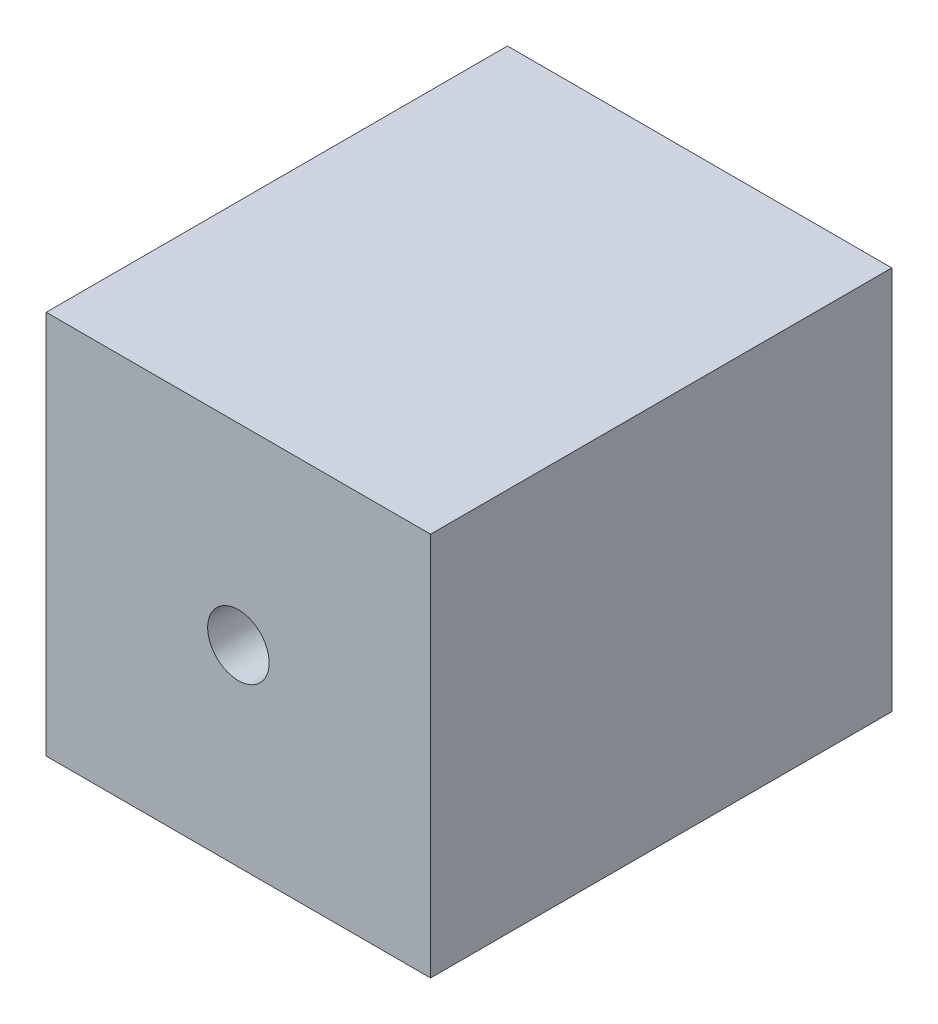
ISO-10303-21;
HEADER;
FILE_DESCRIPTION(('STEP AP214'),'2;1');
FILE_NAME('part.step','',(''),(''),'','','');
FILE_SCHEMA(('AUTOMOTIVE_DESIGN { 1 0 10303 214 1 1 1 1 }'));
ENDSEC;
DATA;
#1=APPLICATION_CONTEXT('core data for automotive mechanical design processes');
#2=APPLICATION_PROTOCOL_DEFINITION('international standard','automotive_design',2000,#1);
#3=PRODUCT_CONTEXT('',#1,'mechanical');
#4=PRODUCT('Part','Part','',(#3));
#5=PRODUCT_RELATED_PRODUCT_CATEGORY('part','',(#4));
#6=PRODUCT_DEFINITION_FORMATION('','',#4);
#7=PRODUCT_DEFINITION_CONTEXT('part definition',#1,'design');
#8=PRODUCT_DEFINITION('design','',#6,#7);
#9=PRODUCT_DEFINITION_SHAPE('','',#8);
#10=(LENGTH_UNIT() NAMED_UNIT(*) SI_UNIT(.MILLI.,.METRE.));
#11=(NAMED_UNIT(*) PLANE_ANGLE_UNIT() SI_UNIT($,.RADIAN.));
#12=(NAMED_UNIT(*) SI_UNIT($,.STERADIAN.) SOLID_ANGLE_UNIT());
#13=UNCERTAINTY_MEASURE_WITH_UNIT(LENGTH_MEASURE(1.E-05),#10,'distance_accuracy_value','');
#14=(GEOMETRIC_REPRESENTATION_CONTEXT(3) GLOBAL_UNCERTAINTY_ASSIGNED_CONTEXT((#13)) GLOBAL_UNIT_ASSIGNED_CONTEXT((#10,
#11,#12)) REPRESENTATION_CONTEXT('',''));
#15=CARTESIAN_POINT('',(0.,0.,0.));
#16=DIRECTION('',(0.,0.,1.));
#17=DIRECTION('',(1.,0.,0.));
#18=AXIS2_PLACEMENT_3D('',#15,#16,#17);
#19=CARTESIAN_POINT('',(-5.,5.,12.));
#20=DIRECTION('',(1.,0.,0.));
#21=DIRECTION('',(0.,1.,0.));
#22=AXIS2_PLACEMENT_3D('',#19,#20,#21);
#23=PLANE('',#22);
#24=DIRECTION('',(0.,-1.,0.));
#25=VECTOR('',#24,1.);
#26=CARTESIAN_POINT('',(-5.,5.,0.));
#27=LINE('',#26,#25);
#28=CARTESIAN_POINT('',(-5.,5.,0.));
#29=VERTEX_POINT('',#28);
#30=CARTESIAN_POINT('',(-5.,-5.,0.));
#31=VERTEX_POINT('',#30);
#32=EDGE_CURVE('E105',#29,#31,#27,.T.);
#33=ORIENTED_EDGE('',*,*,#32,.T.);
#34=DIRECTION('',(0.,0.,-1.));
#35=VECTOR('',#34,1.);
#36=CARTESIAN_POINT('',(-5.,-5.,12.));
#37=LINE('',#36,#35);
#38=CARTESIAN_POINT('',(-5.,-5.,12.));
#39=VERTEX_POINT('',#38);
#40=EDGE_CURVE('E11',#39,#31,#37,.T.);
#41=ORIENTED_EDGE('',*,*,#40,.F.);
#42=DIRECTION('',(0.,-1.,0.));
#43=VECTOR('',#42,1.);
#44=CARTESIAN_POINT('',(-5.,5.,12.));
#45=LINE('',#44,#43);
#46=CARTESIAN_POINT('',(-5.,5.,12.));
#47=VERTEX_POINT('',#46);
#48=EDGE_CURVE('E92',#47,#39,#45,.T.);
#49=ORIENTED_EDGE('',*,*,#48,.F.);
#50=DIRECTION('',(0.,0.,-1.));
#51=VECTOR('',#50,1.);
#52=CARTESIAN_POINT('',(-5.,5.,12.));
#53=LINE('',#52,#51);
#54=EDGE_CURVE('E101',#47,#29,#53,.T.);
#55=ORIENTED_EDGE('',*,*,#54,.T.);
#56=EDGE_LOOP('',(#33,#41,#49,#55));
#57=FACE_BOUND('',#56,.T.);
#58=ADVANCED_FACE('F40',(#57),#23,.F.);
#59=CARTESIAN_POINT('',(5.,-5.,12.));
#60=DIRECTION('',(0.,1.,0.));
#61=DIRECTION('',(-1.,0.,0.));
#62=AXIS2_PLACEMENT_3D('',#59,#60,#61);
#63=PLANE('',#62);
#64=DIRECTION('',(1.,0.,0.));
#65=VECTOR('',#64,1.);
#66=CARTESIAN_POINT('',(5.,-5.,0.));
#67=LINE('',#66,#65);
#68=CARTESIAN_POINT('',(5.,-5.,0.));
#69=VERTEX_POINT('',#68);
#70=EDGE_CURVE('E96',#31,#69,#67,.T.);
#71=ORIENTED_EDGE('',*,*,#70,.T.);
#72=DIRECTION('',(0.,0.,-1.));
#73=VECTOR('',#72,1.);
#74=CARTESIAN_POINT('',(5.,-5.,12.));
#75=LINE('',#74,#73);
#76=CARTESIAN_POINT('',(5.,-5.,12.));
#77=VERTEX_POINT('',#76);
#78=EDGE_CURVE('E49',#77,#69,#75,.T.);
#79=ORIENTED_EDGE('',*,*,#78,.F.);
#80=DIRECTION('',(1.,0.,0.));
#81=VECTOR('',#80,1.);
#82=CARTESIAN_POINT('',(5.,-5.,12.));
#83=LINE('',#82,#81);
#84=EDGE_CURVE('E87',#39,#77,#83,.T.);
#85=ORIENTED_EDGE('',*,*,#84,.F.);
#86=ORIENTED_EDGE('',*,*,#40,.T.);
#87=EDGE_LOOP('',(#71,#79,#85,#86));
#88=FACE_BOUND('',#87,.T.);
#89=ADVANCED_FACE('F95',(#88),#63,.F.);
#90=CARTESIAN_POINT('',(5.,5.,12.));
#91=DIRECTION('',(-1.,0.,0.));
#92=DIRECTION('',(0.,-1.,0.));
#93=AXIS2_PLACEMENT_3D('',#90,#91,#92);
#94=PLANE('',#93);
#95=DIRECTION('',(0.,1.,0.));
#96=VECTOR('',#95,1.);
#97=CARTESIAN_POINT('',(5.,5.,0.));
#98=LINE('',#97,#96);
#99=CARTESIAN_POINT('',(5.,5.,0.));
#100=VERTEX_POINT('',#99);
#101=EDGE_CURVE('E74',#69,#100,#98,.T.);
#102=ORIENTED_EDGE('',*,*,#101,.T.);
#103=DIRECTION('',(0.,0.,-1.));
#104=VECTOR('',#103,1.);
#105=CARTESIAN_POINT('',(5.,5.,12.));
#106=LINE('',#105,#104);
#107=CARTESIAN_POINT('',(5.,5.,12.));
#108=VERTEX_POINT('',#107);
#109=EDGE_CURVE('E97',#108,#100,#106,.T.);
#110=ORIENTED_EDGE('',*,*,#109,.F.);
#111=DIRECTION('',(0.,1.,0.));
#112=VECTOR('',#111,1.);
#113=CARTESIAN_POINT('',(5.,5.,12.));
#114=LINE('',#113,#112);
#115=EDGE_CURVE('E90',#77,#108,#114,.T.);
#116=ORIENTED_EDGE('',*,*,#115,.F.);
#117=ORIENTED_EDGE('',*,*,#78,.T.);
#118=EDGE_LOOP('',(#102,#110,#116,#117));
#119=FACE_BOUND('',#118,.T.);
#120=ADVANCED_FACE('F99',(#119),#94,.F.);
#121=CARTESIAN_POINT('',(5.,5.,12.));
#122=DIRECTION('',(0.,-1.,0.));
#123=DIRECTION('',(1.,0.,0.));
#124=AXIS2_PLACEMENT_3D('',#121,#122,#123);
#125=PLANE('',#124);
#126=DIRECTION('',(-1.,0.,0.));
#127=VECTOR('',#126,1.);
#128=CARTESIAN_POINT('',(5.,5.,0.));
#129=LINE('',#128,#127);
#130=EDGE_CURVE('E80',#100,#29,#129,.T.);
#131=ORIENTED_EDGE('',*,*,#130,.T.);
#132=ORIENTED_EDGE('',*,*,#54,.F.);
#133=DIRECTION('',(-1.,0.,0.));
#134=VECTOR('',#133,1.);
#135=CARTESIAN_POINT('',(5.,5.,12.));
#136=LINE('',#135,#134);
#137=EDGE_CURVE('E57',#108,#47,#136,.T.);
#138=ORIENTED_EDGE('',*,*,#137,.F.);
#139=ORIENTED_EDGE('',*,*,#109,.T.);
#140=EDGE_LOOP('',(#131,#132,#138,#139));
#141=FACE_BOUND('',#140,.T.);
#142=ADVANCED_FACE('F113',(#141),#125,.F.);
#143=CARTESIAN_POINT('',(0.,0.,12.));
#144=DIRECTION('',(0.,0.,-1.));
#145=DIRECTION('',(-1.,0.,0.));
#146=AXIS2_PLACEMENT_3D('',#143,#144,#145);
#147=PLANE('',#146);
#148=CARTESIAN_POINT('',(0.,0.,12.));
#149=DIRECTION('',(0.,0.,1.));
#150=DIRECTION('',(1.,0.,0.));
#151=AXIS2_PLACEMENT_3D('',#148,#149,#150);
#152=CIRCLE('',#151,0.8);
#153=CARTESIAN_POINT('',(0.8,0.,12.));
#154=VERTEX_POINT('',#153);
#155=EDGE_CURVE('E124',#154,#154,#152,.T.);
#156=ORIENTED_EDGE('',*,*,#155,.F.);
#157=EDGE_LOOP('',(#156));
#158=FACE_BOUND('',#157,.T.);
#159=ORIENTED_EDGE('',*,*,#48,.T.);
#160=ORIENTED_EDGE('',*,*,#84,.T.);
#161=ORIENTED_EDGE('',*,*,#115,.T.);
#162=ORIENTED_EDGE('',*,*,#137,.T.);
#163=EDGE_LOOP('',(#159,#160,#161,#162));
#164=FACE_BOUND('',#163,.T.);
#165=ADVANCED_FACE('F88',(#158,#164),#147,.F.);
#166=CARTESIAN_POINT('',(0.,0.,0.));
#167=DIRECTION('',(0.,0.,-1.));
#168=DIRECTION('',(-1.,0.,0.));
#169=AXIS2_PLACEMENT_3D('',#166,#167,#168);
#170=PLANE('',#169);
#171=CARTESIAN_POINT('',(0.,0.,0.));
#172=DIRECTION('',(0.,0.,-1.));
#173=DIRECTION('',(-1.,0.,0.));
#174=AXIS2_PLACEMENT_3D('',#171,#172,#173);
#175=CIRCLE('',#174,2.0193);
#176=CARTESIAN_POINT('',(-2.0193,0.,0.));
#177=VERTEX_POINT('',#176);
#178=EDGE_CURVE('E121',#177,#177,#175,.T.);
#179=ORIENTED_EDGE('',*,*,#178,.F.);
#180=EDGE_LOOP('',(#179));
#181=FACE_BOUND('',#180,.T.);
#182=ORIENTED_EDGE('',*,*,#32,.F.);
#183=ORIENTED_EDGE('',*,*,#130,.F.);
#184=ORIENTED_EDGE('',*,*,#101,.F.);
#185=ORIENTED_EDGE('',*,*,#70,.F.);
#186=EDGE_LOOP('',(#182,#183,#184,#185));
#187=FACE_BOUND('',#186,.T.);
#188=ADVANCED_FACE('F116',(#181,#187),#170,.T.);
#189=CARTESIAN_POINT('',(0.,0.,5.));
#190=DIRECTION('',(0.,0.,-1.));
#191=DIRECTION('',(-1.,0.,0.));
#192=AXIS2_PLACEMENT_3D('',#189,#190,#191);
#193=CONICAL_SURFACE('',#192,2.0193,1.02974425867665);
#194=CARTESIAN_POINT('',(0.,0.,5.7326293527803));
#195=DIRECTION('',(0.,0.,-1.));
#196=DIRECTION('',(-1.,0.,0.));
#197=AXIS2_PLACEMENT_3D('',#194,#195,#196);
#198=CIRCLE('',#197,0.799999999999999);
#199=CARTESIAN_POINT('',(-0.799999999999999,0.,5.7326293527803));
#200=VERTEX_POINT('',#199);
#201=EDGE_CURVE('E43',#200,#200,#198,.F.);
#202=ORIENTED_EDGE('',*,*,#201,.T.);
#203=EDGE_LOOP('',(#202));
#204=FACE_BOUND('',#203,.T.);
#205=CARTESIAN_POINT('',(0.,0.,5.));
#206=DIRECTION('',(0.,0.,-1.));
#207=DIRECTION('',(-1.,0.,0.));
#208=AXIS2_PLACEMENT_3D('',#205,#206,#207);
#209=CIRCLE('',#208,2.0193);
#210=CARTESIAN_POINT('',(-2.0193,0.,5.));
#211=VERTEX_POINT('',#210);
#212=EDGE_CURVE('E108',#211,#211,#209,.T.);
#213=ORIENTED_EDGE('',*,*,#212,.T.);
#214=EDGE_LOOP('',(#213));
#215=FACE_BOUND('',#214,.T.);
#216=ADVANCED_FACE('F131',(#204,#215),#193,.F.);
#217=CARTESIAN_POINT('',(0.,0.,0.));
#218=DIRECTION('',(0.,0.,-1.));
#219=DIRECTION('',(-1.,0.,0.));
#220=AXIS2_PLACEMENT_3D('',#217,#218,#219);
#221=CYLINDRICAL_SURFACE('',#220,2.0193);
#222=ORIENTED_EDGE('',*,*,#212,.F.);
#223=EDGE_LOOP('',(#222));
#224=FACE_BOUND('',#223,.T.);
#225=ORIENTED_EDGE('',*,*,#178,.T.);
#226=EDGE_LOOP('',(#225));
#227=FACE_BOUND('',#226,.T.);
#228=ADVANCED_FACE('F136',(#224,#227),#221,.F.);
#229=CARTESIAN_POINT('',(0.,0.,12.));
#230=DIRECTION('',(0.,0.,1.));
#231=DIRECTION('',(1.,0.,0.));
#232=AXIS2_PLACEMENT_3D('',#229,#230,#231);
#233=CYLINDRICAL_SURFACE('',#232,0.799999999999999);
#234=ORIENTED_EDGE('',*,*,#155,.T.);
#235=EDGE_LOOP('',(#234));
#236=FACE_BOUND('',#235,.T.);
#237=ORIENTED_EDGE('',*,*,#201,.F.);
#238=EDGE_LOOP('',(#237));
#239=FACE_BOUND('',#238,.T.);
#240=ADVANCED_FACE('F134',(#236,#239),#233,.F.);
#241=CLOSED_SHELL('',(#58,#89,#120,#142,#165,#188,#216,#228,#240));
#242=MANIFOLD_SOLID_BREP('B2',#241);
#243=ADVANCED_BREP_SHAPE_REPRESENTATION('',(#18,#242),#14);
#244=SHAPE_DEFINITION_REPRESENTATION(#9,#243);
ENDSEC;
END-ISO-10303-21;
